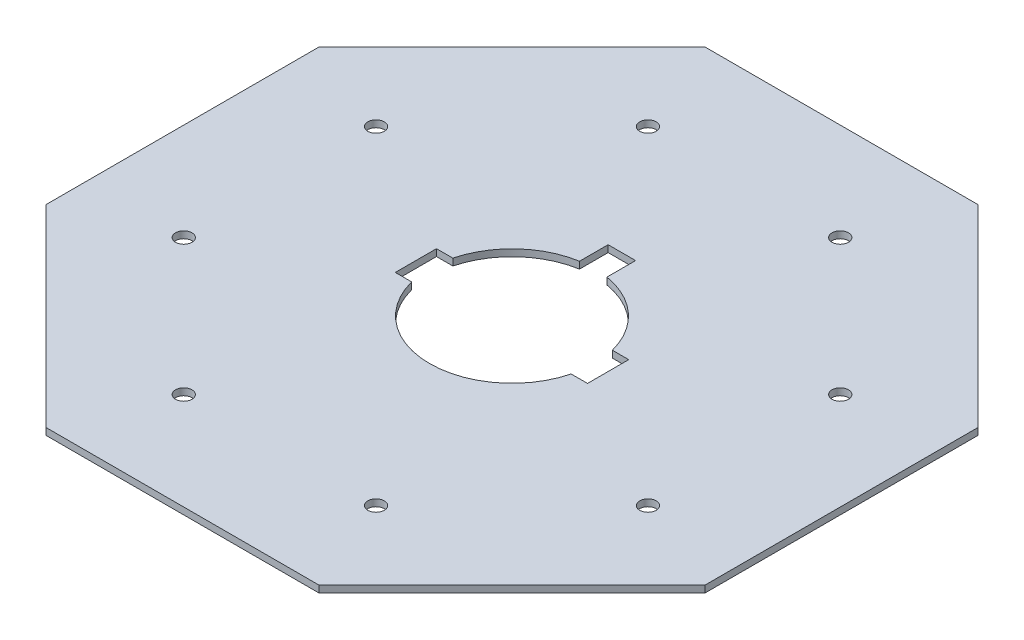
ISO-10303-21;
HEADER;
FILE_DESCRIPTION(('STEP AP214'),'2;1');
FILE_NAME('part.step','',(''),(''),'','','');
FILE_SCHEMA(('AUTOMOTIVE_DESIGN { 1 0 10303 214 1 1 1 1 }'));
ENDSEC;
DATA;
#1=APPLICATION_CONTEXT('core data for automotive mechanical design processes');
#2=APPLICATION_PROTOCOL_DEFINITION('international standard','automotive_design',2000,#1);
#3=PRODUCT_CONTEXT('',#1,'mechanical');
#4=PRODUCT('Part','Part','',(#3));
#5=PRODUCT_RELATED_PRODUCT_CATEGORY('part','',(#4));
#6=PRODUCT_DEFINITION_FORMATION('','',#4);
#7=PRODUCT_DEFINITION_CONTEXT('part definition',#1,'design');
#8=PRODUCT_DEFINITION('design','',#6,#7);
#9=PRODUCT_DEFINITION_SHAPE('','',#8);
#10=(LENGTH_UNIT() NAMED_UNIT(*) SI_UNIT(.MILLI.,.METRE.));
#11=(NAMED_UNIT(*) PLANE_ANGLE_UNIT() SI_UNIT($,.RADIAN.));
#12=(NAMED_UNIT(*) SI_UNIT($,.STERADIAN.) SOLID_ANGLE_UNIT());
#13=UNCERTAINTY_MEASURE_WITH_UNIT(LENGTH_MEASURE(1.E-05),#10,'distance_accuracy_value','');
#14=(GEOMETRIC_REPRESENTATION_CONTEXT(3) GLOBAL_UNCERTAINTY_ASSIGNED_CONTEXT((#13)) GLOBAL_UNIT_ASSIGNED_CONTEXT((#10,
#11,#12)) REPRESENTATION_CONTEXT('',''));
#15=CARTESIAN_POINT('',(0.,0.,0.));
#16=DIRECTION('',(0.,0.,1.));
#17=DIRECTION('',(1.,0.,0.));
#18=AXIS2_PLACEMENT_3D('',#15,#16,#17);
#19=CARTESIAN_POINT('',(0.,0.,0.));
#20=DIRECTION('',(0.,1.,0.));
#21=DIRECTION('',(0.,0.,1.));
#22=AXIS2_PLACEMENT_3D('',#19,#20,#21);
#23=CYLINDRICAL_SURFACE('',#22,38.1);
#24=CARTESIAN_POINT('',(0.,0.,0.));
#25=DIRECTION('',(0.,1.,0.));
#26=DIRECTION('',(0.,0.,1.));
#27=AXIS2_PLACEMENT_3D('',#24,#25,#26);
#28=CIRCLE('',#27,38.1);
#29=CARTESIAN_POINT('',(-36.8901663726257,0.,9.525));
#30=VERTEX_POINT('',#29);
#31=CARTESIAN_POINT('',(36.8901663726257,0.,9.525));
#32=VERTEX_POINT('',#31);
#33=EDGE_CURVE('E289',#30,#32,#28,.T.);
#34=ORIENTED_EDGE('',*,*,#33,.F.);
#35=DIRECTION('',(0.,1.,0.));
#36=VECTOR('',#35,1.);
#37=CARTESIAN_POINT('',(-36.8901663726257,0.,9.525));
#38=LINE('',#37,#36);
#39=CARTESIAN_POINT('',(-36.8901663726257,3.175,9.525));
#40=VERTEX_POINT('',#39);
#41=EDGE_CURVE('E11',#30,#40,#38,.T.);
#42=ORIENTED_EDGE('',*,*,#41,.T.);
#43=CARTESIAN_POINT('',(0.,3.175,0.));
#44=DIRECTION('',(0.,1.,0.));
#45=DIRECTION('',(0.,0.,1.));
#46=AXIS2_PLACEMENT_3D('',#43,#44,#45);
#47=CIRCLE('',#46,38.1);
#48=CARTESIAN_POINT('',(36.8901663726257,3.175,9.525));
#49=VERTEX_POINT('',#48);
#50=EDGE_CURVE('E295',#40,#49,#47,.T.);
#51=ORIENTED_EDGE('',*,*,#50,.T.);
#52=DIRECTION('',(0.,1.,0.));
#53=VECTOR('',#52,1.);
#54=CARTESIAN_POINT('',(36.8901663726257,0.,9.525));
#55=LINE('',#54,#53);
#56=EDGE_CURVE('E366',#49,#32,#55,.F.);
#57=ORIENTED_EDGE('',*,*,#56,.T.);
#58=EDGE_LOOP('',(#34,#42,#51,#57));
#59=FACE_BOUND('',#58,.T.);
#60=ADVANCED_FACE('F35',(#59),#23,.F.);
#61=CARTESIAN_POINT('',(-6.35,3.175,-37.5671066226826));
#62=VERTEX_POINT('',#61);
#63=CARTESIAN_POINT('',(-36.8901663726257,3.175,-9.525));
#64=VERTEX_POINT('',#63);
#65=EDGE_CURVE('E298',#62,#64,#47,.T.);
#66=ORIENTED_EDGE('',*,*,#65,.T.);
#67=DIRECTION('',(0.,1.,0.));
#68=VECTOR('',#67,1.);
#69=CARTESIAN_POINT('',(-36.8901663726257,0.,-9.525));
#70=LINE('',#69,#68);
#71=CARTESIAN_POINT('',(-36.8901663726257,0.,-9.525));
#72=VERTEX_POINT('',#71);
#73=EDGE_CURVE('E43',#64,#72,#70,.F.);
#74=ORIENTED_EDGE('',*,*,#73,.T.);
#75=CARTESIAN_POINT('',(-6.35,0.,-37.5671066226826));
#76=VERTEX_POINT('',#75);
#77=EDGE_CURVE('E193',#76,#72,#28,.T.);
#78=ORIENTED_EDGE('',*,*,#77,.F.);
#79=DIRECTION('',(0.,1.,0.));
#80=VECTOR('',#79,1.);
#81=CARTESIAN_POINT('',(-6.35,0.,-37.5671066226826));
#82=LINE('',#81,#80);
#83=EDGE_CURVE('E358',#76,#62,#82,.T.);
#84=ORIENTED_EDGE('',*,*,#83,.T.);
#85=EDGE_LOOP('',(#66,#74,#78,#84));
#86=FACE_BOUND('',#85,.T.);
#87=ADVANCED_FACE('F370',(#86),#23,.F.);
#88=CARTESIAN_POINT('',(152.4,3.175,-63.1261469056597));
#89=DIRECTION('',(-0.707106781186548,0.,0.707106781186547));
#90=DIRECTION('',(0.707106781186547,0.,0.707106781186548));
#91=AXIS2_PLACEMENT_3D('',#88,#89,#90);
#92=PLANE('',#91);
#93=DIRECTION('',(-0.707106781186548,0.,-0.707106781186548));
#94=VECTOR('',#93,1.);
#95=CARTESIAN_POINT('',(152.4,0.,-63.1261469056597));
#96=LINE('',#95,#94);
#97=CARTESIAN_POINT('',(152.4,0.,-63.1261469056597));
#98=VERTEX_POINT('',#97);
#99=CARTESIAN_POINT('',(63.1261469056596,0.,-152.4));
#100=VERTEX_POINT('',#99);
#101=EDGE_CURVE('E319',#98,#100,#96,.T.);
#102=ORIENTED_EDGE('',*,*,#101,.T.);
#103=DIRECTION('',(0.,-1.,0.));
#104=VECTOR('',#103,1.);
#105=CARTESIAN_POINT('',(63.1261469056596,3.175,-152.4));
#106=LINE('',#105,#104);
#107=CARTESIAN_POINT('',(63.1261469056596,3.175,-152.4));
#108=VERTEX_POINT('',#107);
#109=EDGE_CURVE('E355',#108,#100,#106,.T.);
#110=ORIENTED_EDGE('',*,*,#109,.F.);
#111=DIRECTION('',(-0.707106781186548,0.,-0.707106781186548));
#112=VECTOR('',#111,1.);
#113=CARTESIAN_POINT('',(152.4,3.175,-63.1261469056597));
#114=LINE('',#113,#112);
#115=CARTESIAN_POINT('',(152.4,3.175,-63.1261469056597));
#116=VERTEX_POINT('',#115);
#117=EDGE_CURVE('E300',#116,#108,#114,.T.);
#118=ORIENTED_EDGE('',*,*,#117,.F.);
#119=DIRECTION('',(0.,-1.,0.));
#120=VECTOR('',#119,1.);
#121=CARTESIAN_POINT('',(152.4,3.175,-63.1261469056597));
#122=LINE('',#121,#120);
#123=EDGE_CURVE('E318',#116,#98,#122,.T.);
#124=ORIENTED_EDGE('',*,*,#123,.T.);
#125=EDGE_LOOP('',(#102,#110,#118,#124));
#126=FACE_BOUND('',#125,.T.);
#127=ADVANCED_FACE('F37',(#126),#92,.F.);
#128=CARTESIAN_POINT('',(63.1261469056596,3.175,-152.4));
#129=DIRECTION('',(0.,0.,1.));
#130=DIRECTION('',(1.,0.,0.));
#131=AXIS2_PLACEMENT_3D('',#128,#129,#130);
#132=PLANE('',#131);
#133=DIRECTION('',(-1.,0.,0.));
#134=VECTOR('',#133,1.);
#135=CARTESIAN_POINT('',(63.1261469056596,0.,-152.4));
#136=LINE('',#135,#134);
#137=CARTESIAN_POINT('',(-63.1261469056597,0.,-152.4));
#138=VERTEX_POINT('',#137);
#139=EDGE_CURVE('E322',#100,#138,#136,.T.);
#140=ORIENTED_EDGE('',*,*,#139,.T.);
#141=DIRECTION('',(0.,-1.,0.));
#142=VECTOR('',#141,1.);
#143=CARTESIAN_POINT('',(-63.1261469056597,3.175,-152.4));
#144=LINE('',#143,#142);
#145=CARTESIAN_POINT('',(-63.1261469056597,3.175,-152.4));
#146=VERTEX_POINT('',#145);
#147=EDGE_CURVE('E352',#146,#138,#144,.T.);
#148=ORIENTED_EDGE('',*,*,#147,.F.);
#149=DIRECTION('',(-1.,0.,0.));
#150=VECTOR('',#149,1.);
#151=CARTESIAN_POINT('',(63.1261469056596,3.175,-152.4));
#152=LINE('',#151,#150);
#153=EDGE_CURVE('E303',#108,#146,#152,.T.);
#154=ORIENTED_EDGE('',*,*,#153,.F.);
#155=ORIENTED_EDGE('',*,*,#109,.T.);
#156=EDGE_LOOP('',(#140,#148,#154,#155));
#157=FACE_BOUND('',#156,.T.);
#158=ADVANCED_FACE('F461',(#157),#132,.F.);
#159=CARTESIAN_POINT('',(-63.1261469056597,3.175,-152.4));
#160=DIRECTION('',(0.707106781186548,0.,0.707106781186547));
#161=DIRECTION('',(0.707106781186547,0.,-0.707106781186548));
#162=AXIS2_PLACEMENT_3D('',#159,#160,#161);
#163=PLANE('',#162);
#164=DIRECTION('',(-0.707106781186547,0.,0.707106781186548));
#165=VECTOR('',#164,1.);
#166=CARTESIAN_POINT('',(-63.1261469056597,0.,-152.4));
#167=LINE('',#166,#165);
#168=CARTESIAN_POINT('',(-152.4,0.,-63.1261469056597));
#169=VERTEX_POINT('',#168);
#170=EDGE_CURVE('E324',#138,#169,#167,.T.);
#171=ORIENTED_EDGE('',*,*,#170,.T.);
#172=DIRECTION('',(0.,-1.,0.));
#173=VECTOR('',#172,1.);
#174=CARTESIAN_POINT('',(-152.4,3.175,-63.1261469056597));
#175=LINE('',#174,#173);
#176=CARTESIAN_POINT('',(-152.4,3.175,-63.1261469056597));
#177=VERTEX_POINT('',#176);
#178=EDGE_CURVE('E349',#177,#169,#175,.T.);
#179=ORIENTED_EDGE('',*,*,#178,.F.);
#180=DIRECTION('',(-0.707106781186547,0.,0.707106781186548));
#181=VECTOR('',#180,1.);
#182=CARTESIAN_POINT('',(-63.1261469056597,3.175,-152.4));
#183=LINE('',#182,#181);
#184=EDGE_CURVE('E306',#146,#177,#183,.T.);
#185=ORIENTED_EDGE('',*,*,#184,.F.);
#186=ORIENTED_EDGE('',*,*,#147,.T.);
#187=EDGE_LOOP('',(#171,#179,#185,#186));
#188=FACE_BOUND('',#187,.T.);
#189=ADVANCED_FACE('F458',(#188),#163,.F.);
#190=CARTESIAN_POINT('',(-152.4,3.175,-63.1261469056597));
#191=DIRECTION('',(1.,0.,0.));
#192=DIRECTION('',(0.,0.,-1.));
#193=AXIS2_PLACEMENT_3D('',#190,#191,#192);
#194=PLANE('',#193);
#195=DIRECTION('',(0.,0.,1.));
#196=VECTOR('',#195,1.);
#197=CARTESIAN_POINT('',(-152.4,0.,-63.1261469056597));
#198=LINE('',#197,#196);
#199=CARTESIAN_POINT('',(-152.4,0.,63.1261469056597));
#200=VERTEX_POINT('',#199);
#201=EDGE_CURVE('E326',#169,#200,#198,.T.);
#202=ORIENTED_EDGE('',*,*,#201,.T.);
#203=DIRECTION('',(0.,-1.,0.));
#204=VECTOR('',#203,1.);
#205=CARTESIAN_POINT('',(-152.4,3.175,63.1261469056597));
#206=LINE('',#205,#204);
#207=CARTESIAN_POINT('',(-152.4,3.175,63.1261469056597));
#208=VERTEX_POINT('',#207);
#209=EDGE_CURVE('E346',#208,#200,#206,.T.);
#210=ORIENTED_EDGE('',*,*,#209,.F.);
#211=DIRECTION('',(0.,0.,1.));
#212=VECTOR('',#211,1.);
#213=CARTESIAN_POINT('',(-152.4,3.175,-63.1261469056597));
#214=LINE('',#213,#212);
#215=EDGE_CURVE('E308',#177,#208,#214,.T.);
#216=ORIENTED_EDGE('',*,*,#215,.F.);
#217=ORIENTED_EDGE('',*,*,#178,.T.);
#218=EDGE_LOOP('',(#202,#210,#216,#217));
#219=FACE_BOUND('',#218,.T.);
#220=ADVANCED_FACE('F454',(#219),#194,.F.);
#221=CARTESIAN_POINT('',(-152.4,3.175,63.1261469056597));
#222=DIRECTION('',(0.707106781186548,0.,-0.707106781186548));
#223=DIRECTION('',(-0.707106781186548,0.,-0.707106781186548));
#224=AXIS2_PLACEMENT_3D('',#221,#222,#223);
#225=PLANE('',#224);
#226=DIRECTION('',(0.707106781186548,0.,0.707106781186548));
#227=VECTOR('',#226,1.);
#228=CARTESIAN_POINT('',(-152.4,0.,63.1261469056597));
#229=LINE('',#228,#227);
#230=CARTESIAN_POINT('',(-63.1261469056597,0.,152.4));
#231=VERTEX_POINT('',#230);
#232=EDGE_CURVE('E328',#200,#231,#229,.T.);
#233=ORIENTED_EDGE('',*,*,#232,.T.);
#234=DIRECTION('',(0.,-1.,0.));
#235=VECTOR('',#234,1.);
#236=CARTESIAN_POINT('',(-63.1261469056597,3.175,152.4));
#237=LINE('',#236,#235);
#238=CARTESIAN_POINT('',(-63.1261469056597,3.175,152.4));
#239=VERTEX_POINT('',#238);
#240=EDGE_CURVE('E343',#239,#231,#237,.T.);
#241=ORIENTED_EDGE('',*,*,#240,.F.);
#242=DIRECTION('',(0.707106781186548,0.,0.707106781186548));
#243=VECTOR('',#242,1.);
#244=CARTESIAN_POINT('',(-152.4,3.175,63.1261469056597));
#245=LINE('',#244,#243);
#246=EDGE_CURVE('E310',#208,#239,#245,.T.);
#247=ORIENTED_EDGE('',*,*,#246,.F.);
#248=ORIENTED_EDGE('',*,*,#209,.T.);
#249=EDGE_LOOP('',(#233,#241,#247,#248));
#250=FACE_BOUND('',#249,.T.);
#251=ADVANCED_FACE('F450',(#250),#225,.F.);
#252=CARTESIAN_POINT('',(-63.1261469056597,3.175,152.4));
#253=DIRECTION('',(0.,0.,-1.));
#254=DIRECTION('',(-1.,0.,0.));
#255=AXIS2_PLACEMENT_3D('',#252,#253,#254);
#256=PLANE('',#255);
#257=DIRECTION('',(1.,0.,0.));
#258=VECTOR('',#257,1.);
#259=CARTESIAN_POINT('',(-63.1261469056597,0.,152.4));
#260=LINE('',#259,#258);
#261=CARTESIAN_POINT('',(63.1261469056597,0.,152.4));
#262=VERTEX_POINT('',#261);
#263=EDGE_CURVE('E330',#231,#262,#260,.T.);
#264=ORIENTED_EDGE('',*,*,#263,.T.);
#265=DIRECTION('',(0.,-1.,0.));
#266=VECTOR('',#265,1.);
#267=CARTESIAN_POINT('',(63.1261469056597,3.175,152.4));
#268=LINE('',#267,#266);
#269=CARTESIAN_POINT('',(63.1261469056597,3.175,152.4));
#270=VERTEX_POINT('',#269);
#271=EDGE_CURVE('E340',#270,#262,#268,.T.);
#272=ORIENTED_EDGE('',*,*,#271,.F.);
#273=DIRECTION('',(1.,0.,0.));
#274=VECTOR('',#273,1.);
#275=CARTESIAN_POINT('',(-63.1261469056597,3.175,152.4));
#276=LINE('',#275,#274);
#277=EDGE_CURVE('E312',#239,#270,#276,.T.);
#278=ORIENTED_EDGE('',*,*,#277,.F.);
#279=ORIENTED_EDGE('',*,*,#240,.T.);
#280=EDGE_LOOP('',(#264,#272,#278,#279));
#281=FACE_BOUND('',#280,.T.);
#282=ADVANCED_FACE('F446',(#281),#256,.F.);
#283=CARTESIAN_POINT('',(63.1261469056597,3.175,152.4));
#284=DIRECTION('',(-0.707106781186547,0.,-0.707106781186548));
#285=DIRECTION('',(-0.707106781186548,0.,0.707106781186547));
#286=AXIS2_PLACEMENT_3D('',#283,#284,#285);
#287=PLANE('',#286);
#288=DIRECTION('',(0.707106781186548,0.,-0.707106781186547));
#289=VECTOR('',#288,1.);
#290=CARTESIAN_POINT('',(63.1261469056597,0.,152.4));
#291=LINE('',#290,#289);
#292=CARTESIAN_POINT('',(152.4,0.,63.1261469056597));
#293=VERTEX_POINT('',#292);
#294=EDGE_CURVE('E332',#262,#293,#291,.T.);
#295=ORIENTED_EDGE('',*,*,#294,.T.);
#296=DIRECTION('',(0.,-1.,0.));
#297=VECTOR('',#296,1.);
#298=CARTESIAN_POINT('',(152.4,3.175,63.1261469056597));
#299=LINE('',#298,#297);
#300=CARTESIAN_POINT('',(152.4,3.175,63.1261469056597));
#301=VERTEX_POINT('',#300);
#302=EDGE_CURVE('E337',#301,#293,#299,.T.);
#303=ORIENTED_EDGE('',*,*,#302,.F.);
#304=DIRECTION('',(0.707106781186548,0.,-0.707106781186547));
#305=VECTOR('',#304,1.);
#306=CARTESIAN_POINT('',(63.1261469056597,3.175,152.4));
#307=LINE('',#306,#305);
#308=EDGE_CURVE('E314',#270,#301,#307,.T.);
#309=ORIENTED_EDGE('',*,*,#308,.F.);
#310=ORIENTED_EDGE('',*,*,#271,.T.);
#311=EDGE_LOOP('',(#295,#303,#309,#310));
#312=FACE_BOUND('',#311,.T.);
#313=ADVANCED_FACE('F442',(#312),#287,.F.);
#314=CARTESIAN_POINT('',(152.4,3.175,63.1261469056597));
#315=DIRECTION('',(-1.,0.,0.));
#316=DIRECTION('',(0.,0.,1.));
#317=AXIS2_PLACEMENT_3D('',#314,#315,#316);
#318=PLANE('',#317);
#319=DIRECTION('',(0.,0.,-1.));
#320=VECTOR('',#319,1.);
#321=CARTESIAN_POINT('',(152.4,0.,63.1261469056597));
#322=LINE('',#321,#320);
#323=EDGE_CURVE('E304',#293,#98,#322,.T.);
#324=ORIENTED_EDGE('',*,*,#323,.T.);
#325=ORIENTED_EDGE('',*,*,#123,.F.);
#326=DIRECTION('',(0.,0.,-1.));
#327=VECTOR('',#326,1.);
#328=CARTESIAN_POINT('',(152.4,3.175,63.1261469056597));
#329=LINE('',#328,#327);
#330=EDGE_CURVE('E316',#301,#116,#329,.T.);
#331=ORIENTED_EDGE('',*,*,#330,.F.);
#332=ORIENTED_EDGE('',*,*,#302,.T.);
#333=EDGE_LOOP('',(#324,#325,#331,#332));
#334=FACE_BOUND('',#333,.T.);
#335=ADVANCED_FACE('F438',(#334),#318,.F.);
#336=CARTESIAN_POINT('',(0.,3.175,0.));
#337=DIRECTION('',(0.,1.,0.));
#338=DIRECTION('',(0.,0.,1.));
#339=AXIS2_PLACEMENT_3D('',#336,#337,#338);
#340=PLANE('',#339);
#341=DIRECTION('',(1.,0.,0.));
#342=VECTOR('',#341,1.);
#343=CARTESIAN_POINT('',(-44.45,3.175,9.525));
#344=LINE('',#343,#342);
#345=CARTESIAN_POINT('',(-44.45,3.175,9.525));
#346=VERTEX_POINT('',#345);
#347=EDGE_CURVE('E194',#346,#40,#344,.T.);
#348=ORIENTED_EDGE('',*,*,#347,.F.);
#349=DIRECTION('',(0.,0.,1.));
#350=VECTOR('',#349,1.);
#351=CARTESIAN_POINT('',(-44.45,3.175,9.525));
#352=LINE('',#351,#350);
#353=CARTESIAN_POINT('',(-44.45,3.175,-9.525));
#354=VERTEX_POINT('',#353);
#355=EDGE_CURVE('E196',#354,#346,#352,.T.);
#356=ORIENTED_EDGE('',*,*,#355,.F.);
#357=DIRECTION('',(-1.,0.,0.));
#358=VECTOR('',#357,1.);
#359=CARTESIAN_POINT('',(-44.45,3.175,-9.525));
#360=LINE('',#359,#358);
#361=EDGE_CURVE('E174',#64,#354,#360,.T.);
#362=ORIENTED_EDGE('',*,*,#361,.F.);
#363=ORIENTED_EDGE('',*,*,#65,.F.);
#364=DIRECTION('',(0.,0.,1.));
#365=VECTOR('',#364,1.);
#366=CARTESIAN_POINT('',(-6.35,3.175,-25.4));
#367=LINE('',#366,#365);
#368=CARTESIAN_POINT('',(-6.35,3.175,-50.8));
#369=VERTEX_POINT('',#368);
#370=EDGE_CURVE('E58',#369,#62,#367,.T.);
#371=ORIENTED_EDGE('',*,*,#370,.F.);
#372=DIRECTION('',(-1.,0.,0.));
#373=VECTOR('',#372,1.);
#374=CARTESIAN_POINT('',(-6.35,3.175,-50.8));
#375=LINE('',#374,#373);
#376=CARTESIAN_POINT('',(6.35,3.175,-50.8));
#377=VERTEX_POINT('',#376);
#378=EDGE_CURVE('E237',#377,#369,#375,.T.);
#379=ORIENTED_EDGE('',*,*,#378,.F.);
#380=DIRECTION('',(0.,0.,-1.));
#381=VECTOR('',#380,1.);
#382=CARTESIAN_POINT('',(6.35,3.175,-25.4));
#383=LINE('',#382,#381);
#384=CARTESIAN_POINT('',(6.35,3.175,-37.5671066226826));
#385=VERTEX_POINT('',#384);
#386=EDGE_CURVE('E235',#385,#377,#383,.T.);
#387=ORIENTED_EDGE('',*,*,#386,.F.);
#388=CARTESIAN_POINT('',(36.8901663726257,3.175,-9.525));
#389=VERTEX_POINT('',#388);
#390=EDGE_CURVE('E299',#389,#385,#47,.T.);
#391=ORIENTED_EDGE('',*,*,#390,.F.);
#392=DIRECTION('',(-1.,0.,0.));
#393=VECTOR('',#392,1.);
#394=CARTESIAN_POINT('',(31.75,3.175,-9.525));
#395=LINE('',#394,#393);
#396=CARTESIAN_POINT('',(44.45,3.175,-9.525));
#397=VERTEX_POINT('',#396);
#398=EDGE_CURVE('E219',#397,#389,#395,.T.);
#399=ORIENTED_EDGE('',*,*,#398,.F.);
#400=DIRECTION('',(0.,0.,-1.));
#401=VECTOR('',#400,1.);
#402=CARTESIAN_POINT('',(44.45,3.175,9.525));
#403=LINE('',#402,#401);
#404=CARTESIAN_POINT('',(44.45,3.175,9.525));
#405=VERTEX_POINT('',#404);
#406=EDGE_CURVE('E216',#405,#397,#403,.T.);
#407=ORIENTED_EDGE('',*,*,#406,.F.);
#408=DIRECTION('',(1.,0.,0.));
#409=VECTOR('',#408,1.);
#410=CARTESIAN_POINT('',(31.75,3.175,9.525));
#411=LINE('',#410,#409);
#412=EDGE_CURVE('E209',#49,#405,#411,.T.);
#413=ORIENTED_EDGE('',*,*,#412,.F.);
#414=ORIENTED_EDGE('',*,*,#50,.F.);
#415=EDGE_LOOP('',(#348,#356,#362,#363,#371,#379,#387,#391,#399,#407,#413,#414));
#416=FACE_BOUND('',#415,.T.);
#417=CARTESIAN_POINT('',(107.34424295849,3.175,44.463441276079));
#418=DIRECTION('',(0.,1.,0.));
#419=DIRECTION('',(0.,0.,1.));
#420=AXIS2_PLACEMENT_3D('',#417,#418,#419);
#421=CIRCLE('',#420,3.81000000000001);
#422=CARTESIAN_POINT('',(107.34424295849,3.175,48.273441276079));
#423=VERTEX_POINT('',#422);
#424=EDGE_CURVE('E203',#423,#423,#421,.T.);
#425=ORIENTED_EDGE('',*,*,#424,.F.);
#426=EDGE_LOOP('',(#425));
#427=FACE_BOUND('',#426,.T.);
#428=CARTESIAN_POINT('',(107.34424295849,3.175,-44.463441276079));
#429=DIRECTION('',(0.,1.,0.));
#430=DIRECTION('',(0.,0.,1.));
#431=AXIS2_PLACEMENT_3D('',#428,#429,#430);
#432=CIRCLE('',#431,3.81);
#433=CARTESIAN_POINT('',(107.34424295849,3.175,-40.653441276079));
#434=VERTEX_POINT('',#433);
#435=EDGE_CURVE('E278',#434,#434,#432,.T.);
#436=ORIENTED_EDGE('',*,*,#435,.F.);
#437=EDGE_LOOP('',(#436));
#438=FACE_BOUND('',#437,.T.);
#439=CARTESIAN_POINT('',(44.463441276079,3.175,-107.34424295849));
#440=DIRECTION('',(0.,1.,0.));
#441=DIRECTION('',(0.,0.,1.));
#442=AXIS2_PLACEMENT_3D('',#439,#440,#441);
#443=CIRCLE('',#442,3.81000000000001);
#444=CARTESIAN_POINT('',(44.463441276079,3.175,-103.53424295849));
#445=VERTEX_POINT('',#444);
#446=EDGE_CURVE('E272',#445,#445,#443,.T.);
#447=ORIENTED_EDGE('',*,*,#446,.F.);
#448=EDGE_LOOP('',(#447));
#449=FACE_BOUND('',#448,.T.);
#450=CARTESIAN_POINT('',(-44.463441276079,3.175,-107.34424295849));
#451=DIRECTION('',(0.,1.,0.));
#452=DIRECTION('',(0.,0.,1.));
#453=AXIS2_PLACEMENT_3D('',#450,#451,#452);
#454=CIRCLE('',#453,3.81);
#455=CARTESIAN_POINT('',(-44.463441276079,3.175,-103.53424295849));
#456=VERTEX_POINT('',#455);
#457=EDGE_CURVE('E266',#456,#456,#454,.T.);
#458=ORIENTED_EDGE('',*,*,#457,.F.);
#459=EDGE_LOOP('',(#458));
#460=FACE_BOUND('',#459,.T.);
#461=CARTESIAN_POINT('',(-107.34424295849,3.175,-44.463441276079));
#462=DIRECTION('',(0.,1.,0.));
#463=DIRECTION('',(0.,0.,1.));
#464=AXIS2_PLACEMENT_3D('',#461,#462,#463);
#465=CIRCLE('',#464,3.81000000000001);
#466=CARTESIAN_POINT('',(-107.34424295849,3.175,-40.653441276079));
#467=VERTEX_POINT('',#466);
#468=EDGE_CURVE('E260',#467,#467,#465,.T.);
#469=ORIENTED_EDGE('',*,*,#468,.F.);
#470=EDGE_LOOP('',(#469));
#471=FACE_BOUND('',#470,.T.);
#472=CARTESIAN_POINT('',(-107.34424295849,3.175,44.463441276079));
#473=DIRECTION('',(0.,1.,0.));
#474=DIRECTION('',(0.,0.,1.));
#475=AXIS2_PLACEMENT_3D('',#472,#473,#474);
#476=CIRCLE('',#475,3.81000000000001);
#477=CARTESIAN_POINT('',(-107.34424295849,3.175,48.273441276079));
#478=VERTEX_POINT('',#477);
#479=EDGE_CURVE('E254',#478,#478,#476,.T.);
#480=ORIENTED_EDGE('',*,*,#479,.F.);
#481=EDGE_LOOP('',(#480));
#482=FACE_BOUND('',#481,.T.);
#483=CARTESIAN_POINT('',(-44.463441276079,3.175,107.34424295849));
#484=DIRECTION('',(0.,1.,0.));
#485=DIRECTION('',(0.,0.,1.));
#486=AXIS2_PLACEMENT_3D('',#483,#484,#485);
#487=CIRCLE('',#486,3.80999999999999);
#488=CARTESIAN_POINT('',(-44.463441276079,3.175,111.15424295849));
#489=VERTEX_POINT('',#488);
#490=EDGE_CURVE('E248',#489,#489,#487,.T.);
#491=ORIENTED_EDGE('',*,*,#490,.F.);
#492=EDGE_LOOP('',(#491));
#493=FACE_BOUND('',#492,.T.);
#494=CARTESIAN_POINT('',(44.463441276079,3.175,107.34424295849));
#495=DIRECTION('',(0.,1.,0.));
#496=DIRECTION('',(0.,0.,1.));
#497=AXIS2_PLACEMENT_3D('',#494,#495,#496);
#498=CIRCLE('',#497,3.81);
#499=CARTESIAN_POINT('',(44.463441276079,3.175,111.15424295849));
#500=VERTEX_POINT('',#499);
#501=EDGE_CURVE('E247',#500,#500,#498,.T.);
#502=ORIENTED_EDGE('',*,*,#501,.F.);
#503=EDGE_LOOP('',(#502));
#504=FACE_BOUND('',#503,.T.);
#505=ORIENTED_EDGE('',*,*,#117,.T.);
#506=ORIENTED_EDGE('',*,*,#153,.T.);
#507=ORIENTED_EDGE('',*,*,#184,.T.);
#508=ORIENTED_EDGE('',*,*,#215,.T.);
#509=ORIENTED_EDGE('',*,*,#246,.T.);
#510=ORIENTED_EDGE('',*,*,#277,.T.);
#511=ORIENTED_EDGE('',*,*,#308,.T.);
#512=ORIENTED_EDGE('',*,*,#330,.T.);
#513=EDGE_LOOP('',(#505,#506,#507,#508,#509,#510,#511,#512));
#514=FACE_BOUND('',#513,.T.);
#515=ADVANCED_FACE('F374',(#416,#427,#438,#449,#460,#471,#482,#493,#504,#514),#340,.T.);
#516=CARTESIAN_POINT('',(0.,0.,0.));
#517=DIRECTION('',(0.,1.,0.));
#518=DIRECTION('',(0.,0.,1.));
#519=AXIS2_PLACEMENT_3D('',#516,#517,#518);
#520=PLANE('',#519);
#521=DIRECTION('',(0.,0.,1.));
#522=VECTOR('',#521,1.);
#523=CARTESIAN_POINT('',(-44.45,0.,9.525));
#524=LINE('',#523,#522);
#525=CARTESIAN_POINT('',(-44.45,0.,-9.525));
#526=VERTEX_POINT('',#525);
#527=CARTESIAN_POINT('',(-44.45,0.,9.525));
#528=VERTEX_POINT('',#527);
#529=EDGE_CURVE('E182',#526,#528,#524,.T.);
#530=ORIENTED_EDGE('',*,*,#529,.T.);
#531=DIRECTION('',(1.,0.,0.));
#532=VECTOR('',#531,1.);
#533=CARTESIAN_POINT('',(-44.45,0.,9.525));
#534=LINE('',#533,#532);
#535=EDGE_CURVE('E179',#528,#30,#534,.T.);
#536=ORIENTED_EDGE('',*,*,#535,.T.);
#537=ORIENTED_EDGE('',*,*,#33,.T.);
#538=DIRECTION('',(1.,0.,0.));
#539=VECTOR('',#538,1.);
#540=CARTESIAN_POINT('',(31.75,0.,9.525));
#541=LINE('',#540,#539);
#542=CARTESIAN_POINT('',(44.45,0.,9.525));
#543=VERTEX_POINT('',#542);
#544=EDGE_CURVE('E212',#32,#543,#541,.T.);
#545=ORIENTED_EDGE('',*,*,#544,.T.);
#546=DIRECTION('',(0.,0.,-1.));
#547=VECTOR('',#546,1.);
#548=CARTESIAN_POINT('',(44.45,0.,9.525));
#549=LINE('',#548,#547);
#550=CARTESIAN_POINT('',(44.45,0.,-9.525));
#551=VERTEX_POINT('',#550);
#552=EDGE_CURVE('E205',#543,#551,#549,.T.);
#553=ORIENTED_EDGE('',*,*,#552,.T.);
#554=DIRECTION('',(-1.,0.,0.));
#555=VECTOR('',#554,1.);
#556=CARTESIAN_POINT('',(31.75,0.,-9.525));
#557=LINE('',#556,#555);
#558=CARTESIAN_POINT('',(36.8901663726257,0.,-9.525));
#559=VERTEX_POINT('',#558);
#560=EDGE_CURVE('E208',#551,#559,#557,.T.);
#561=ORIENTED_EDGE('',*,*,#560,.T.);
#562=CARTESIAN_POINT('',(6.35,0.,-37.5671066226826));
#563=VERTEX_POINT('',#562);
#564=EDGE_CURVE('E294',#559,#563,#28,.T.);
#565=ORIENTED_EDGE('',*,*,#564,.T.);
#566=DIRECTION('',(0.,0.,-1.));
#567=VECTOR('',#566,1.);
#568=CARTESIAN_POINT('',(6.35,0.,-25.4));
#569=LINE('',#568,#567);
#570=CARTESIAN_POINT('',(6.35,0.,-50.8));
#571=VERTEX_POINT('',#570);
#572=EDGE_CURVE('E226',#563,#571,#569,.T.);
#573=ORIENTED_EDGE('',*,*,#572,.T.);
#574=DIRECTION('',(-1.,0.,0.));
#575=VECTOR('',#574,1.);
#576=CARTESIAN_POINT('',(-6.35,0.,-50.8));
#577=LINE('',#576,#575);
#578=CARTESIAN_POINT('',(-6.35,0.,-50.8));
#579=VERTEX_POINT('',#578);
#580=EDGE_CURVE('E229',#571,#579,#577,.T.);
#581=ORIENTED_EDGE('',*,*,#580,.T.);
#582=DIRECTION('',(0.,0.,1.));
#583=VECTOR('',#582,1.);
#584=CARTESIAN_POINT('',(-6.35,0.,-25.4));
#585=LINE('',#584,#583);
#586=EDGE_CURVE('E232',#579,#76,#585,.T.);
#587=ORIENTED_EDGE('',*,*,#586,.T.);
#588=ORIENTED_EDGE('',*,*,#77,.T.);
#589=DIRECTION('',(-1.,0.,0.));
#590=VECTOR('',#589,1.);
#591=CARTESIAN_POINT('',(-44.45,0.,-9.525));
#592=LINE('',#591,#590);
#593=EDGE_CURVE('E50',#72,#526,#592,.T.);
#594=ORIENTED_EDGE('',*,*,#593,.T.);
#595=EDGE_LOOP('',(#530,#536,#537,#545,#553,#561,#565,#573,#581,#587,#588,#594));
#596=FACE_BOUND('',#595,.T.);
#597=CARTESIAN_POINT('',(107.34424295849,0.,44.463441276079));
#598=DIRECTION('',(0.,1.,0.));
#599=DIRECTION('',(0.,0.,1.));
#600=AXIS2_PLACEMENT_3D('',#597,#598,#599);
#601=CIRCLE('',#600,3.81000000000001);
#602=CARTESIAN_POINT('',(107.34424295849,0.,48.273441276079));
#603=VERTEX_POINT('',#602);
#604=EDGE_CURVE('E281',#603,#603,#601,.T.);
#605=ORIENTED_EDGE('',*,*,#604,.T.);
#606=EDGE_LOOP('',(#605));
#607=FACE_BOUND('',#606,.T.);
#608=CARTESIAN_POINT('',(107.34424295849,0.,-44.463441276079));
#609=DIRECTION('',(0.,1.,0.));
#610=DIRECTION('',(0.,0.,1.));
#611=AXIS2_PLACEMENT_3D('',#608,#609,#610);
#612=CIRCLE('',#611,3.81);
#613=CARTESIAN_POINT('',(107.34424295849,0.,-40.653441276079));
#614=VERTEX_POINT('',#613);
#615=EDGE_CURVE('E275',#614,#614,#612,.T.);
#616=ORIENTED_EDGE('',*,*,#615,.T.);
#617=EDGE_LOOP('',(#616));
#618=FACE_BOUND('',#617,.T.);
#619=CARTESIAN_POINT('',(44.463441276079,0.,-107.34424295849));
#620=DIRECTION('',(0.,1.,0.));
#621=DIRECTION('',(0.,0.,1.));
#622=AXIS2_PLACEMENT_3D('',#619,#620,#621);
#623=CIRCLE('',#622,3.81000000000001);
#624=CARTESIAN_POINT('',(44.463441276079,0.,-103.53424295849));
#625=VERTEX_POINT('',#624);
#626=EDGE_CURVE('E269',#625,#625,#623,.T.);
#627=ORIENTED_EDGE('',*,*,#626,.T.);
#628=EDGE_LOOP('',(#627));
#629=FACE_BOUND('',#628,.T.);
#630=CARTESIAN_POINT('',(-44.463441276079,0.,-107.34424295849));
#631=DIRECTION('',(0.,1.,0.));
#632=DIRECTION('',(0.,0.,1.));
#633=AXIS2_PLACEMENT_3D('',#630,#631,#632);
#634=CIRCLE('',#633,3.81);
#635=CARTESIAN_POINT('',(-44.463441276079,0.,-103.53424295849));
#636=VERTEX_POINT('',#635);
#637=EDGE_CURVE('E263',#636,#636,#634,.T.);
#638=ORIENTED_EDGE('',*,*,#637,.T.);
#639=EDGE_LOOP('',(#638));
#640=FACE_BOUND('',#639,.T.);
#641=CARTESIAN_POINT('',(-107.34424295849,0.,-44.463441276079));
#642=DIRECTION('',(0.,1.,0.));
#643=DIRECTION('',(0.,0.,1.));
#644=AXIS2_PLACEMENT_3D('',#641,#642,#643);
#645=CIRCLE('',#644,3.81000000000001);
#646=CARTESIAN_POINT('',(-107.34424295849,0.,-40.653441276079));
#647=VERTEX_POINT('',#646);
#648=EDGE_CURVE('E257',#647,#647,#645,.T.);
#649=ORIENTED_EDGE('',*,*,#648,.T.);
#650=EDGE_LOOP('',(#649));
#651=FACE_BOUND('',#650,.T.);
#652=CARTESIAN_POINT('',(-107.34424295849,0.,44.463441276079));
#653=DIRECTION('',(0.,1.,0.));
#654=DIRECTION('',(0.,0.,1.));
#655=AXIS2_PLACEMENT_3D('',#652,#653,#654);
#656=CIRCLE('',#655,3.81000000000001);
#657=CARTESIAN_POINT('',(-107.34424295849,0.,48.273441276079));
#658=VERTEX_POINT('',#657);
#659=EDGE_CURVE('E251',#658,#658,#656,.T.);
#660=ORIENTED_EDGE('',*,*,#659,.T.);
#661=EDGE_LOOP('',(#660));
#662=FACE_BOUND('',#661,.T.);
#663=CARTESIAN_POINT('',(-44.463441276079,0.,107.34424295849));
#664=DIRECTION('',(0.,1.,0.));
#665=DIRECTION('',(0.,0.,1.));
#666=AXIS2_PLACEMENT_3D('',#663,#664,#665);
#667=CIRCLE('',#666,3.80999999999999);
#668=CARTESIAN_POINT('',(-44.463441276079,0.,111.15424295849));
#669=VERTEX_POINT('',#668);
#670=EDGE_CURVE('E244',#669,#669,#667,.T.);
#671=ORIENTED_EDGE('',*,*,#670,.T.);
#672=EDGE_LOOP('',(#671));
#673=FACE_BOUND('',#672,.T.);
#674=CARTESIAN_POINT('',(44.463441276079,0.,107.34424295849));
#675=DIRECTION('',(0.,1.,0.));
#676=DIRECTION('',(0.,0.,1.));
#677=AXIS2_PLACEMENT_3D('',#674,#675,#676);
#678=CIRCLE('',#677,3.81);
#679=CARTESIAN_POINT('',(44.463441276079,0.,111.15424295849));
#680=VERTEX_POINT('',#679);
#681=EDGE_CURVE('E286',#680,#680,#678,.T.);
#682=ORIENTED_EDGE('',*,*,#681,.T.);
#683=EDGE_LOOP('',(#682));
#684=FACE_BOUND('',#683,.T.);
#685=ORIENTED_EDGE('',*,*,#101,.F.);
#686=ORIENTED_EDGE('',*,*,#323,.F.);
#687=ORIENTED_EDGE('',*,*,#294,.F.);
#688=ORIENTED_EDGE('',*,*,#263,.F.);
#689=ORIENTED_EDGE('',*,*,#232,.F.);
#690=ORIENTED_EDGE('',*,*,#201,.F.);
#691=ORIENTED_EDGE('',*,*,#170,.F.);
#692=ORIENTED_EDGE('',*,*,#139,.F.);
#693=EDGE_LOOP('',(#685,#686,#687,#688,#689,#690,#691,#692));
#694=FACE_BOUND('',#693,.T.);
#695=ADVANCED_FACE('F189',(#596,#607,#618,#629,#640,#651,#662,#673,#684,#694),#520,.F.);
#696=ORIENTED_EDGE('',*,*,#564,.F.);
#697=DIRECTION('',(0.,1.,0.));
#698=VECTOR('',#697,1.);
#699=CARTESIAN_POINT('',(36.8901663726257,0.,-9.525));
#700=LINE('',#699,#698);
#701=EDGE_CURVE('E363',#559,#389,#700,.T.);
#702=ORIENTED_EDGE('',*,*,#701,.T.);
#703=ORIENTED_EDGE('',*,*,#390,.T.);
#704=DIRECTION('',(0.,1.,0.));
#705=VECTOR('',#704,1.);
#706=CARTESIAN_POINT('',(6.35,0.,-37.5671066226826));
#707=LINE('',#706,#705);
#708=EDGE_CURVE('E360',#385,#563,#707,.F.);
#709=ORIENTED_EDGE('',*,*,#708,.T.);
#710=EDGE_LOOP('',(#696,#702,#703,#709));
#711=FACE_BOUND('',#710,.T.);
#712=ADVANCED_FACE('F395',(#711),#23,.F.);
#713=CARTESIAN_POINT('',(44.463441276079,0.,107.34424295849));
#714=DIRECTION('',(0.,1.,0.));
#715=DIRECTION('',(0.,0.,1.));
#716=AXIS2_PLACEMENT_3D('',#713,#714,#715);
#717=CYLINDRICAL_SURFACE('',#716,3.81);
#718=ORIENTED_EDGE('',*,*,#681,.F.);
#719=EDGE_LOOP('',(#718));
#720=FACE_BOUND('',#719,.T.);
#721=ORIENTED_EDGE('',*,*,#501,.T.);
#722=EDGE_LOOP('',(#721));
#723=FACE_BOUND('',#722,.T.);
#724=ADVANCED_FACE('F426',(#720,#723),#717,.F.);
#725=CARTESIAN_POINT('',(-44.463441276079,0.,107.34424295849));
#726=DIRECTION('',(0.,1.,0.));
#727=DIRECTION('',(0.,0.,1.));
#728=AXIS2_PLACEMENT_3D('',#725,#726,#727);
#729=CYLINDRICAL_SURFACE('',#728,3.80999999999999);
#730=ORIENTED_EDGE('',*,*,#670,.F.);
#731=EDGE_LOOP('',(#730));
#732=FACE_BOUND('',#731,.T.);
#733=ORIENTED_EDGE('',*,*,#490,.T.);
#734=EDGE_LOOP('',(#733));
#735=FACE_BOUND('',#734,.T.);
#736=ADVANCED_FACE('F432',(#732,#735),#729,.F.);
#737=CARTESIAN_POINT('',(-107.34424295849,0.,44.463441276079));
#738=DIRECTION('',(0.,1.,0.));
#739=DIRECTION('',(0.,0.,1.));
#740=AXIS2_PLACEMENT_3D('',#737,#738,#739);
#741=CYLINDRICAL_SURFACE('',#740,3.81000000000001);
#742=ORIENTED_EDGE('',*,*,#659,.F.);
#743=EDGE_LOOP('',(#742));
#744=FACE_BOUND('',#743,.T.);
#745=ORIENTED_EDGE('',*,*,#479,.T.);
#746=EDGE_LOOP('',(#745));
#747=FACE_BOUND('',#746,.T.);
#748=ADVANCED_FACE('F531',(#744,#747),#741,.F.);
#749=CARTESIAN_POINT('',(-107.34424295849,0.,-44.463441276079));
#750=DIRECTION('',(0.,1.,0.));
#751=DIRECTION('',(0.,0.,1.));
#752=AXIS2_PLACEMENT_3D('',#749,#750,#751);
#753=CYLINDRICAL_SURFACE('',#752,3.81000000000001);
#754=ORIENTED_EDGE('',*,*,#648,.F.);
#755=EDGE_LOOP('',(#754));
#756=FACE_BOUND('',#755,.T.);
#757=ORIENTED_EDGE('',*,*,#468,.T.);
#758=EDGE_LOOP('',(#757));
#759=FACE_BOUND('',#758,.T.);
#760=ADVANCED_FACE('F539',(#756,#759),#753,.F.);
#761=CARTESIAN_POINT('',(-44.463441276079,0.,-107.34424295849));
#762=DIRECTION('',(0.,1.,0.));
#763=DIRECTION('',(0.,0.,1.));
#764=AXIS2_PLACEMENT_3D('',#761,#762,#763);
#765=CYLINDRICAL_SURFACE('',#764,3.81);
#766=ORIENTED_EDGE('',*,*,#637,.F.);
#767=EDGE_LOOP('',(#766));
#768=FACE_BOUND('',#767,.T.);
#769=ORIENTED_EDGE('',*,*,#457,.T.);
#770=EDGE_LOOP('',(#769));
#771=FACE_BOUND('',#770,.T.);
#772=ADVANCED_FACE('F547',(#768,#771),#765,.F.);
#773=CARTESIAN_POINT('',(44.463441276079,0.,-107.34424295849));
#774=DIRECTION('',(0.,1.,0.));
#775=DIRECTION('',(0.,0.,1.));
#776=AXIS2_PLACEMENT_3D('',#773,#774,#775);
#777=CYLINDRICAL_SURFACE('',#776,3.81000000000001);
#778=ORIENTED_EDGE('',*,*,#626,.F.);
#779=EDGE_LOOP('',(#778));
#780=FACE_BOUND('',#779,.T.);
#781=ORIENTED_EDGE('',*,*,#446,.T.);
#782=EDGE_LOOP('',(#781));
#783=FACE_BOUND('',#782,.T.);
#784=ADVANCED_FACE('F555',(#780,#783),#777,.F.);
#785=CARTESIAN_POINT('',(107.34424295849,0.,-44.463441276079));
#786=DIRECTION('',(0.,1.,0.));
#787=DIRECTION('',(0.,0.,1.));
#788=AXIS2_PLACEMENT_3D('',#785,#786,#787);
#789=CYLINDRICAL_SURFACE('',#788,3.81);
#790=ORIENTED_EDGE('',*,*,#615,.F.);
#791=EDGE_LOOP('',(#790));
#792=FACE_BOUND('',#791,.T.);
#793=ORIENTED_EDGE('',*,*,#435,.T.);
#794=EDGE_LOOP('',(#793));
#795=FACE_BOUND('',#794,.T.);
#796=ADVANCED_FACE('F563',(#792,#795),#789,.F.);
#797=CARTESIAN_POINT('',(107.34424295849,0.,44.463441276079));
#798=DIRECTION('',(0.,1.,0.));
#799=DIRECTION('',(0.,0.,1.));
#800=AXIS2_PLACEMENT_3D('',#797,#798,#799);
#801=CYLINDRICAL_SURFACE('',#800,3.81000000000001);
#802=ORIENTED_EDGE('',*,*,#604,.F.);
#803=EDGE_LOOP('',(#802));
#804=FACE_BOUND('',#803,.T.);
#805=ORIENTED_EDGE('',*,*,#424,.T.);
#806=EDGE_LOOP('',(#805));
#807=FACE_BOUND('',#806,.T.);
#808=ADVANCED_FACE('F414',(#804,#807),#801,.F.);
#809=CARTESIAN_POINT('',(6.35,0.,-25.4));
#810=DIRECTION('',(1.,0.,0.));
#811=DIRECTION('',(0.,0.,-1.));
#812=AXIS2_PLACEMENT_3D('',#809,#810,#811);
#813=PLANE('',#812);
#814=ORIENTED_EDGE('',*,*,#386,.T.);
#815=DIRECTION('',(0.,1.,0.));
#816=VECTOR('',#815,1.);
#817=CARTESIAN_POINT('',(6.35,0.,-50.8));
#818=LINE('',#817,#816);
#819=EDGE_CURVE('E234',#571,#377,#818,.T.);
#820=ORIENTED_EDGE('',*,*,#819,.F.);
#821=ORIENTED_EDGE('',*,*,#572,.F.);
#822=ORIENTED_EDGE('',*,*,#708,.F.);
#823=EDGE_LOOP('',(#814,#820,#821,#822));
#824=FACE_BOUND('',#823,.T.);
#825=ADVANCED_FACE('F400',(#824),#813,.F.);
#826=CARTESIAN_POINT('',(-6.35,0.,-25.4));
#827=DIRECTION('',(-1.,0.,0.));
#828=DIRECTION('',(0.,0.,1.));
#829=AXIS2_PLACEMENT_3D('',#826,#827,#828);
#830=PLANE('',#829);
#831=ORIENTED_EDGE('',*,*,#586,.F.);
#832=DIRECTION('',(0.,1.,0.));
#833=VECTOR('',#832,1.);
#834=CARTESIAN_POINT('',(-6.35,0.,-50.8));
#835=LINE('',#834,#833);
#836=EDGE_CURVE('E220',#579,#369,#835,.T.);
#837=ORIENTED_EDGE('',*,*,#836,.T.);
#838=ORIENTED_EDGE('',*,*,#370,.T.);
#839=ORIENTED_EDGE('',*,*,#83,.F.);
#840=EDGE_LOOP('',(#831,#837,#838,#839));
#841=FACE_BOUND('',#840,.T.);
#842=ADVANCED_FACE('F406',(#841),#830,.F.);
#843=CARTESIAN_POINT('',(-6.35,0.,-50.8));
#844=DIRECTION('',(0.,0.,-1.));
#845=DIRECTION('',(-1.,0.,0.));
#846=AXIS2_PLACEMENT_3D('',#843,#844,#845);
#847=PLANE('',#846);
#848=ORIENTED_EDGE('',*,*,#378,.T.);
#849=ORIENTED_EDGE('',*,*,#836,.F.);
#850=ORIENTED_EDGE('',*,*,#580,.F.);
#851=ORIENTED_EDGE('',*,*,#819,.T.);
#852=EDGE_LOOP('',(#848,#849,#850,#851));
#853=FACE_BOUND('',#852,.T.);
#854=ADVANCED_FACE('F403',(#853),#847,.F.);
#855=CARTESIAN_POINT('',(31.75,0.,9.525));
#856=DIRECTION('',(0.,0.,1.));
#857=DIRECTION('',(1.,0.,0.));
#858=AXIS2_PLACEMENT_3D('',#855,#856,#857);
#859=PLANE('',#858);
#860=ORIENTED_EDGE('',*,*,#412,.T.);
#861=DIRECTION('',(0.,1.,0.));
#862=VECTOR('',#861,1.);
#863=CARTESIAN_POINT('',(44.45,0.,9.525));
#864=LINE('',#863,#862);
#865=EDGE_CURVE('E201',#543,#405,#864,.T.);
#866=ORIENTED_EDGE('',*,*,#865,.F.);
#867=ORIENTED_EDGE('',*,*,#544,.F.);
#868=ORIENTED_EDGE('',*,*,#56,.F.);
#869=EDGE_LOOP('',(#860,#866,#867,#868));
#870=FACE_BOUND('',#869,.T.);
#871=ADVANCED_FACE('F384',(#870),#859,.F.);
#872=CARTESIAN_POINT('',(31.75,0.,-9.525));
#873=DIRECTION('',(0.,0.,-1.));
#874=DIRECTION('',(-1.,0.,0.));
#875=AXIS2_PLACEMENT_3D('',#872,#873,#874);
#876=PLANE('',#875);
#877=ORIENTED_EDGE('',*,*,#560,.F.);
#878=DIRECTION('',(0.,1.,0.));
#879=VECTOR('',#878,1.);
#880=CARTESIAN_POINT('',(44.45,0.,-9.525));
#881=LINE('',#880,#879);
#882=EDGE_CURVE('E215',#551,#397,#881,.T.);
#883=ORIENTED_EDGE('',*,*,#882,.T.);
#884=ORIENTED_EDGE('',*,*,#398,.T.);
#885=ORIENTED_EDGE('',*,*,#701,.F.);
#886=EDGE_LOOP('',(#877,#883,#884,#885));
#887=FACE_BOUND('',#886,.T.);
#888=ADVANCED_FACE('F391',(#887),#876,.F.);
#889=CARTESIAN_POINT('',(44.45,0.,9.525));
#890=DIRECTION('',(1.,0.,0.));
#891=DIRECTION('',(0.,0.,-1.));
#892=AXIS2_PLACEMENT_3D('',#889,#890,#891);
#893=PLANE('',#892);
#894=ORIENTED_EDGE('',*,*,#406,.T.);
#895=ORIENTED_EDGE('',*,*,#882,.F.);
#896=ORIENTED_EDGE('',*,*,#552,.F.);
#897=ORIENTED_EDGE('',*,*,#865,.T.);
#898=EDGE_LOOP('',(#894,#895,#896,#897));
#899=FACE_BOUND('',#898,.T.);
#900=ADVANCED_FACE('F387',(#899),#893,.F.);
#901=CARTESIAN_POINT('',(-44.45,0.,9.525));
#902=DIRECTION('',(0.,0.,1.));
#903=DIRECTION('',(1.,0.,0.));
#904=AXIS2_PLACEMENT_3D('',#901,#902,#903);
#905=PLANE('',#904);
#906=ORIENTED_EDGE('',*,*,#535,.F.);
#907=DIRECTION('',(0.,1.,0.));
#908=VECTOR('',#907,1.);
#909=CARTESIAN_POINT('',(-44.45,0.,9.525));
#910=LINE('',#909,#908);
#911=EDGE_CURVE('E178',#528,#346,#910,.T.);
#912=ORIENTED_EDGE('',*,*,#911,.T.);
#913=ORIENTED_EDGE('',*,*,#347,.T.);
#914=ORIENTED_EDGE('',*,*,#41,.F.);
#915=EDGE_LOOP('',(#906,#912,#913,#914));
#916=FACE_BOUND('',#915,.T.);
#917=ADVANCED_FACE('F379',(#916),#905,.F.);
#918=CARTESIAN_POINT('',(-44.45,0.,-9.525));
#919=DIRECTION('',(0.,0.,-1.));
#920=DIRECTION('',(-1.,0.,0.));
#921=AXIS2_PLACEMENT_3D('',#918,#919,#920);
#922=PLANE('',#921);
#923=ORIENTED_EDGE('',*,*,#361,.T.);
#924=DIRECTION('',(0.,1.,0.));
#925=VECTOR('',#924,1.);
#926=CARTESIAN_POINT('',(-44.45,0.,-9.525));
#927=LINE('',#926,#925);
#928=EDGE_CURVE('E170',#526,#354,#927,.T.);
#929=ORIENTED_EDGE('',*,*,#928,.F.);
#930=ORIENTED_EDGE('',*,*,#593,.F.);
#931=ORIENTED_EDGE('',*,*,#73,.F.);
#932=EDGE_LOOP('',(#923,#929,#930,#931));
#933=FACE_BOUND('',#932,.T.);
#934=ADVANCED_FACE('F172',(#933),#922,.F.);
#935=CARTESIAN_POINT('',(-44.45,0.,9.525));
#936=DIRECTION('',(-1.,0.,0.));
#937=DIRECTION('',(0.,0.,1.));
#938=AXIS2_PLACEMENT_3D('',#935,#936,#937);
#939=PLANE('',#938);
#940=ORIENTED_EDGE('',*,*,#355,.T.);
#941=ORIENTED_EDGE('',*,*,#911,.F.);
#942=ORIENTED_EDGE('',*,*,#529,.F.);
#943=ORIENTED_EDGE('',*,*,#928,.T.);
#944=EDGE_LOOP('',(#940,#941,#942,#943));
#945=FACE_BOUND('',#944,.T.);
#946=ADVANCED_FACE('F183',(#945),#939,.F.);
#947=CLOSED_SHELL('',(#60,#87,#127,#158,#189,#220,#251,#282,#313,#335,#515,#695,#712,#724,#736,
#748,#760,#772,#784,#796,#808,#825,#842,#854,#871,#888,#900,#917,#934,#946));
#948=MANIFOLD_SOLID_BREP('B2',#947);
#949=ADVANCED_BREP_SHAPE_REPRESENTATION('',(#18,#948),#14);
#950=SHAPE_DEFINITION_REPRESENTATION(#9,#949);
ENDSEC;
END-ISO-10303-21;
